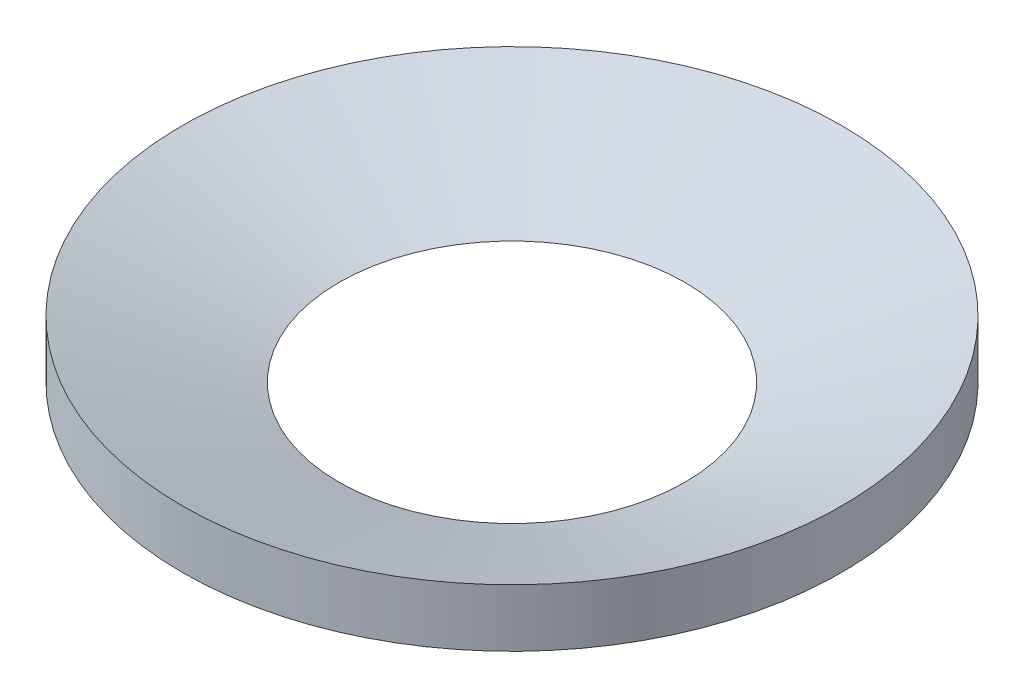
ISO-10303-21;
HEADER;
FILE_DESCRIPTION(('STEP AP214'),'2;1');
FILE_NAME('part.step','',(''),(''),'','','');
FILE_SCHEMA(('AUTOMOTIVE_DESIGN { 1 0 10303 214 1 1 1 1 }'));
ENDSEC;
DATA;
#1=APPLICATION_CONTEXT('core data for automotive mechanical design processes');
#2=APPLICATION_PROTOCOL_DEFINITION('international standard','automotive_design',2000,#1);
#3=PRODUCT_CONTEXT('',#1,'mechanical');
#4=PRODUCT('Part','Part','',(#3));
#5=PRODUCT_RELATED_PRODUCT_CATEGORY('part','',(#4));
#6=PRODUCT_DEFINITION_FORMATION('','',#4);
#7=PRODUCT_DEFINITION_CONTEXT('part definition',#1,'design');
#8=PRODUCT_DEFINITION('design','',#6,#7);
#9=PRODUCT_DEFINITION_SHAPE('','',#8);
#10=(LENGTH_UNIT() NAMED_UNIT(*) SI_UNIT(.MILLI.,.METRE.));
#11=(NAMED_UNIT(*) PLANE_ANGLE_UNIT() SI_UNIT($,.RADIAN.));
#12=(NAMED_UNIT(*) SI_UNIT($,.STERADIAN.) SOLID_ANGLE_UNIT());
#13=UNCERTAINTY_MEASURE_WITH_UNIT(LENGTH_MEASURE(1.E-05),#10,'distance_accuracy_value','');
#14=(GEOMETRIC_REPRESENTATION_CONTEXT(3) GLOBAL_UNCERTAINTY_ASSIGNED_CONTEXT((#13)) GLOBAL_UNIT_ASSIGNED_CONTEXT((#10,
#11,#12)) REPRESENTATION_CONTEXT('',''));
#15=CARTESIAN_POINT('',(0.,0.,0.));
#16=DIRECTION('',(0.,0.,1.));
#17=DIRECTION('',(1.,0.,0.));
#18=AXIS2_PLACEMENT_3D('',#15,#16,#17);
#19=CARTESIAN_POINT('',(0.,3.5,0.));
#20=DIRECTION('',(0.,1.,0.));
#21=DIRECTION('',(0.,0.,1.));
#22=AXIS2_PLACEMENT_3D('',#19,#20,#21);
#23=CONICAL_SURFACE('',#22,20.,1.21780593896799);
#24=CARTESIAN_POINT('',(0.,0.,0.));
#25=DIRECTION('',(0.,-1.,0.));
#26=DIRECTION('',(0.,0.,-1.));
#27=AXIS2_PLACEMENT_3D('',#24,#25,#26);
#28=CIRCLE('',#27,10.5);
#29=CARTESIAN_POINT('',(0.,0.,-10.5));
#30=VERTEX_POINT('',#29);
#31=EDGE_CURVE('E41',#30,#30,#28,.T.);
#32=ORIENTED_EDGE('',*,*,#31,.T.);
#33=EDGE_LOOP('',(#32));
#34=FACE_BOUND('',#33,.T.);
#35=CARTESIAN_POINT('',(0.,3.5,0.));
#36=DIRECTION('',(0.,-1.,0.));
#37=DIRECTION('',(0.,0.,-1.));
#38=AXIS2_PLACEMENT_3D('',#35,#36,#37);
#39=CIRCLE('',#38,20.);
#40=CARTESIAN_POINT('',(0.,3.5,-20.));
#41=VERTEX_POINT('',#40);
#42=EDGE_CURVE('E10',#41,#41,#39,.T.);
#43=ORIENTED_EDGE('',*,*,#42,.F.);
#44=EDGE_LOOP('',(#43));
#45=FACE_BOUND('',#44,.T.);
#46=ADVANCED_FACE('F31',(#34,#45),#23,.F.);
#47=CARTESIAN_POINT('',(0.,0.,0.));
#48=DIRECTION('',(0.,-1.,0.));
#49=DIRECTION('',(0.,0.,-1.));
#50=AXIS2_PLACEMENT_3D('',#47,#48,#49);
#51=CYLINDRICAL_SURFACE('',#50,20.);
#52=ORIENTED_EDGE('',*,*,#42,.T.);
#53=EDGE_LOOP('',(#52));
#54=FACE_BOUND('',#53,.T.);
#55=CARTESIAN_POINT('',(0.,0.,0.));
#56=DIRECTION('',(0.,-1.,0.));
#57=DIRECTION('',(0.,0.,-1.));
#58=AXIS2_PLACEMENT_3D('',#55,#56,#57);
#59=CIRCLE('',#58,20.);
#60=CARTESIAN_POINT('',(0.,0.,-20.));
#61=VERTEX_POINT('',#60);
#62=EDGE_CURVE('E37',#61,#61,#59,.T.);
#63=ORIENTED_EDGE('',*,*,#62,.F.);
#64=EDGE_LOOP('',(#63));
#65=FACE_BOUND('',#64,.T.);
#66=ADVANCED_FACE('F52',(#54,#65),#51,.T.);
#67=CARTESIAN_POINT('',(10.5,0.,0.));
#68=DIRECTION('',(0.,-1.,0.));
#69=DIRECTION('',(0.,0.,-1.));
#70=AXIS2_PLACEMENT_3D('',#67,#68,#69);
#71=PLANE('',#70);
#72=ORIENTED_EDGE('',*,*,#62,.T.);
#73=EDGE_LOOP('',(#72));
#74=FACE_BOUND('',#73,.T.);
#75=ORIENTED_EDGE('',*,*,#31,.F.);
#76=EDGE_LOOP('',(#75));
#77=FACE_BOUND('',#76,.T.);
#78=ADVANCED_FACE('F50',(#74,#77),#71,.T.);
#79=CLOSED_SHELL('',(#46,#66,#78));
#80=MANIFOLD_SOLID_BREP('B2',#79);
#81=ADVANCED_BREP_SHAPE_REPRESENTATION('',(#18,#80),#14);
#82=SHAPE_DEFINITION_REPRESENTATION(#9,#81);
ENDSEC;
END-ISO-10303-21;
